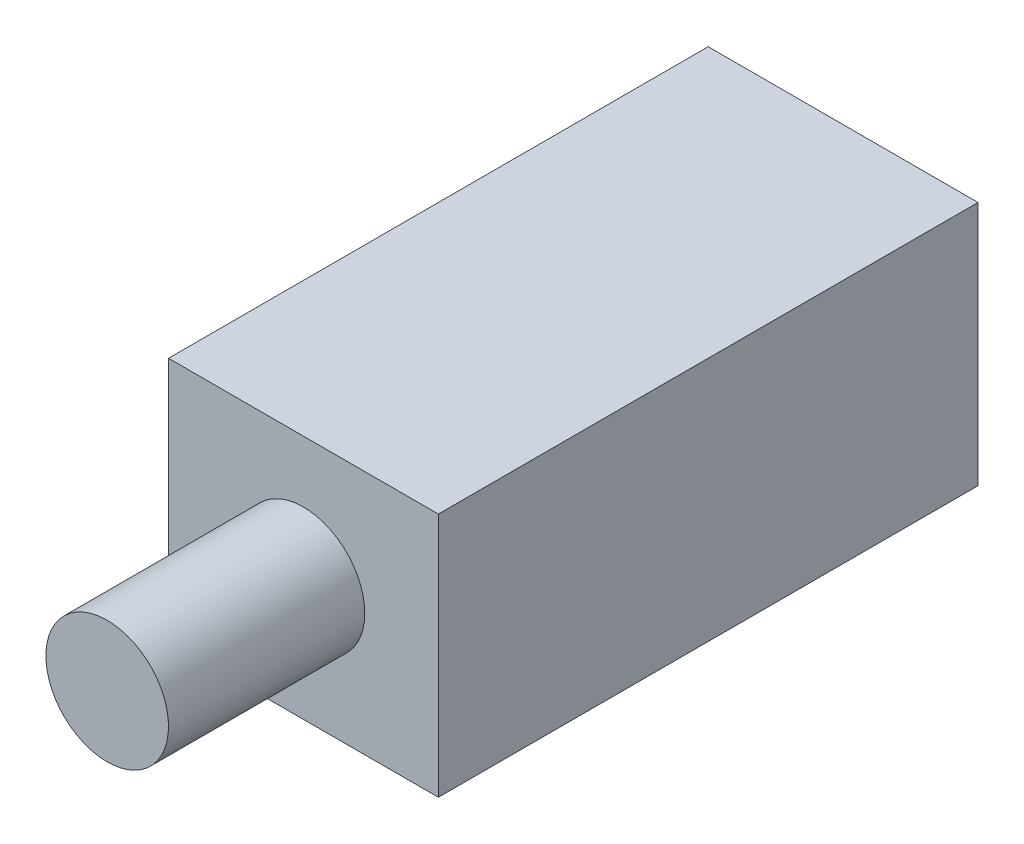
ISO-10303-21;
HEADER;
FILE_DESCRIPTION(('STEP AP214'),'2;1');
FILE_NAME('part.step','',(''),(''),'','','');
FILE_SCHEMA(('AUTOMOTIVE_DESIGN { 1 0 10303 214 1 1 1 1 }'));
ENDSEC;
DATA;
#1=APPLICATION_CONTEXT('core data for automotive mechanical design processes');
#2=APPLICATION_PROTOCOL_DEFINITION('international standard','automotive_design',2000,#1);
#3=PRODUCT_CONTEXT('',#1,'mechanical');
#4=PRODUCT('Part','Part','',(#3));
#5=PRODUCT_RELATED_PRODUCT_CATEGORY('part','',(#4));
#6=PRODUCT_DEFINITION_FORMATION('','',#4);
#7=PRODUCT_DEFINITION_CONTEXT('part definition',#1,'design');
#8=PRODUCT_DEFINITION('design','',#6,#7);
#9=PRODUCT_DEFINITION_SHAPE('','',#8);
#10=(LENGTH_UNIT() NAMED_UNIT(*) SI_UNIT(.MILLI.,.METRE.));
#11=(NAMED_UNIT(*) PLANE_ANGLE_UNIT() SI_UNIT($,.RADIAN.));
#12=(NAMED_UNIT(*) SI_UNIT($,.STERADIAN.) SOLID_ANGLE_UNIT());
#13=UNCERTAINTY_MEASURE_WITH_UNIT(LENGTH_MEASURE(1.E-05),#10,'distance_accuracy_value','');
#14=(GEOMETRIC_REPRESENTATION_CONTEXT(3) GLOBAL_UNCERTAINTY_ASSIGNED_CONTEXT((#13)) GLOBAL_UNIT_ASSIGNED_CONTEXT((#10,
#11,#12)) REPRESENTATION_CONTEXT('',''));
#15=CARTESIAN_POINT('',(0.,0.,0.));
#16=DIRECTION('',(0.,0.,1.));
#17=DIRECTION('',(1.,0.,0.));
#18=AXIS2_PLACEMENT_3D('',#15,#16,#17);
#19=CARTESIAN_POINT('',(-5.5,0.,0.));
#20=DIRECTION('',(0.,0.,1.));
#21=DIRECTION('',(1.,0.,0.));
#22=AXIS2_PLACEMENT_3D('',#19,#20,#21);
#23=PLANE('',#22);
#24=DIRECTION('',(0.,-1.,0.));
#25=VECTOR('',#24,1.);
#26=CARTESIAN_POINT('',(-5.5,10.,0.));
#27=LINE('',#26,#25);
#28=CARTESIAN_POINT('',(-5.5,10.,0.));
#29=VERTEX_POINT('',#28);
#30=CARTESIAN_POINT('',(-5.5,0.,0.));
#31=VERTEX_POINT('',#30);
#32=EDGE_CURVE('E96',#29,#31,#27,.T.);
#33=ORIENTED_EDGE('',*,*,#32,.T.);
#34=DIRECTION('',(1.,0.,0.));
#35=VECTOR('',#34,1.);
#36=CARTESIAN_POINT('',(-5.5,0.,0.));
#37=LINE('',#36,#35);
#38=CARTESIAN_POINT('',(5.5,0.,0.));
#39=VERTEX_POINT('',#38);
#40=EDGE_CURVE('E99',#31,#39,#37,.T.);
#41=ORIENTED_EDGE('',*,*,#40,.T.);
#42=DIRECTION('',(0.,1.,0.));
#43=VECTOR('',#42,1.);
#44=CARTESIAN_POINT('',(5.5,10.,0.));
#45=LINE('',#44,#43);
#46=CARTESIAN_POINT('',(5.5,10.,0.));
#47=VERTEX_POINT('',#46);
#48=EDGE_CURVE('E81',#39,#47,#45,.T.);
#49=ORIENTED_EDGE('',*,*,#48,.T.);
#50=DIRECTION('',(-1.,0.,0.));
#51=VECTOR('',#50,1.);
#52=CARTESIAN_POINT('',(-5.5,10.,0.));
#53=LINE('',#52,#51);
#54=EDGE_CURVE('E91',#47,#29,#53,.T.);
#55=ORIENTED_EDGE('',*,*,#54,.T.);
#56=EDGE_LOOP('',(#33,#41,#49,#55));
#57=FACE_BOUND('',#56,.T.);
#58=CARTESIAN_POINT('',(0.,5.,0.));
#59=DIRECTION('',(0.,0.,1.));
#60=DIRECTION('',(1.,0.,0.));
#61=AXIS2_PLACEMENT_3D('',#58,#59,#60);
#62=CIRCLE('',#61,2.5);
#63=CARTESIAN_POINT('',(2.5,5.,0.));
#64=VERTEX_POINT('',#63);
#65=EDGE_CURVE('E133',#64,#64,#62,.T.);
#66=ORIENTED_EDGE('',*,*,#65,.F.);
#67=EDGE_LOOP('',(#66));
#68=FACE_BOUND('',#67,.T.);
#69=ADVANCED_FACE('F30',(#57,#68),#23,.T.);
#70=CARTESIAN_POINT('',(-5.5,10.,-22.));
#71=DIRECTION('',(-1.,0.,0.));
#72=DIRECTION('',(0.,-1.,0.));
#73=AXIS2_PLACEMENT_3D('',#70,#71,#72);
#74=PLANE('',#73);
#75=ORIENTED_EDGE('',*,*,#32,.F.);
#76=DIRECTION('',(0.,0.,1.));
#77=VECTOR('',#76,1.);
#78=CARTESIAN_POINT('',(-5.5,10.,-22.));
#79=LINE('',#78,#77);
#80=CARTESIAN_POINT('',(-5.5,10.,-22.));
#81=VERTEX_POINT('',#80);
#82=EDGE_CURVE('E11',#81,#29,#79,.T.);
#83=ORIENTED_EDGE('',*,*,#82,.F.);
#84=DIRECTION('',(0.,-1.,0.));
#85=VECTOR('',#84,1.);
#86=CARTESIAN_POINT('',(-5.5,10.,-22.));
#87=LINE('',#86,#85);
#88=CARTESIAN_POINT('',(-5.5,0.,-22.));
#89=VERTEX_POINT('',#88);
#90=EDGE_CURVE('E89',#81,#89,#87,.T.);
#91=ORIENTED_EDGE('',*,*,#90,.T.);
#92=DIRECTION('',(0.,0.,1.));
#93=VECTOR('',#92,1.);
#94=CARTESIAN_POINT('',(-5.5,0.,-22.));
#95=LINE('',#94,#93);
#96=EDGE_CURVE('E34',#89,#31,#95,.T.);
#97=ORIENTED_EDGE('',*,*,#96,.T.);
#98=EDGE_LOOP('',(#75,#83,#91,#97));
#99=FACE_BOUND('',#98,.T.);
#100=ADVANCED_FACE('F32',(#99),#74,.T.);
#101=CARTESIAN_POINT('',(-5.5,10.,-22.));
#102=DIRECTION('',(0.,1.,0.));
#103=DIRECTION('',(0.,0.,1.));
#104=AXIS2_PLACEMENT_3D('',#101,#102,#103);
#105=PLANE('',#104);
#106=ORIENTED_EDGE('',*,*,#54,.F.);
#107=DIRECTION('',(0.,0.,1.));
#108=VECTOR('',#107,1.);
#109=CARTESIAN_POINT('',(5.5,10.,-22.));
#110=LINE('',#109,#108);
#111=CARTESIAN_POINT('',(5.5,10.,-22.));
#112=VERTEX_POINT('',#111);
#113=EDGE_CURVE('E40',#112,#47,#110,.T.);
#114=ORIENTED_EDGE('',*,*,#113,.F.);
#115=DIRECTION('',(-1.,0.,0.));
#116=VECTOR('',#115,1.);
#117=CARTESIAN_POINT('',(-5.5,10.,-22.));
#118=LINE('',#117,#116);
#119=EDGE_CURVE('E86',#112,#81,#118,.T.);
#120=ORIENTED_EDGE('',*,*,#119,.T.);
#121=ORIENTED_EDGE('',*,*,#82,.T.);
#122=EDGE_LOOP('',(#106,#114,#120,#121));
#123=FACE_BOUND('',#122,.T.);
#124=ADVANCED_FACE('F107',(#123),#105,.T.);
#125=CARTESIAN_POINT('',(5.5,10.,-22.));
#126=DIRECTION('',(1.,0.,0.));
#127=DIRECTION('',(0.,1.,0.));
#128=AXIS2_PLACEMENT_3D('',#125,#126,#127);
#129=PLANE('',#128);
#130=ORIENTED_EDGE('',*,*,#48,.F.);
#131=DIRECTION('',(0.,0.,1.));
#132=VECTOR('',#131,1.);
#133=CARTESIAN_POINT('',(5.5,0.,-22.));
#134=LINE('',#133,#132);
#135=CARTESIAN_POINT('',(5.5,0.,-22.));
#136=VERTEX_POINT('',#135);
#137=EDGE_CURVE('E76',#136,#39,#134,.T.);
#138=ORIENTED_EDGE('',*,*,#137,.F.);
#139=DIRECTION('',(0.,1.,0.));
#140=VECTOR('',#139,1.);
#141=CARTESIAN_POINT('',(5.5,10.,-22.));
#142=LINE('',#141,#140);
#143=EDGE_CURVE('E79',#136,#112,#142,.T.);
#144=ORIENTED_EDGE('',*,*,#143,.T.);
#145=ORIENTED_EDGE('',*,*,#113,.T.);
#146=EDGE_LOOP('',(#130,#138,#144,#145));
#147=FACE_BOUND('',#146,.T.);
#148=ADVANCED_FACE('F78',(#147),#129,.T.);
#149=CARTESIAN_POINT('',(-5.5,0.,-22.));
#150=DIRECTION('',(0.,-1.,0.));
#151=DIRECTION('',(0.,0.,-1.));
#152=AXIS2_PLACEMENT_3D('',#149,#150,#151);
#153=PLANE('',#152);
#154=ORIENTED_EDGE('',*,*,#40,.F.);
#155=ORIENTED_EDGE('',*,*,#96,.F.);
#156=DIRECTION('',(1.,0.,0.));
#157=VECTOR('',#156,1.);
#158=CARTESIAN_POINT('',(-5.5,0.,-22.));
#159=LINE('',#158,#157);
#160=EDGE_CURVE('E85',#89,#136,#159,.T.);
#161=ORIENTED_EDGE('',*,*,#160,.T.);
#162=ORIENTED_EDGE('',*,*,#137,.T.);
#163=EDGE_LOOP('',(#154,#155,#161,#162));
#164=FACE_BOUND('',#163,.T.);
#165=ADVANCED_FACE('F88',(#164),#153,.T.);
#166=CARTESIAN_POINT('',(-5.5,0.,-22.));
#167=DIRECTION('',(0.,0.,1.));
#168=DIRECTION('',(1.,0.,0.));
#169=AXIS2_PLACEMENT_3D('',#166,#167,#168);
#170=PLANE('',#169);
#171=ORIENTED_EDGE('',*,*,#90,.F.);
#172=ORIENTED_EDGE('',*,*,#119,.F.);
#173=ORIENTED_EDGE('',*,*,#143,.F.);
#174=ORIENTED_EDGE('',*,*,#160,.F.);
#175=EDGE_LOOP('',(#171,#172,#173,#174));
#176=FACE_BOUND('',#175,.T.);
#177=ADVANCED_FACE('F84',(#176),#170,.F.);
#178=CARTESIAN_POINT('',(0.,5.,8.));
#179=DIRECTION('',(0.,0.,-1.));
#180=DIRECTION('',(-1.,0.,0.));
#181=AXIS2_PLACEMENT_3D('',#178,#179,#180);
#182=CYLINDRICAL_SURFACE('',#181,2.5);
#183=CARTESIAN_POINT('',(0.,5.,8.));
#184=DIRECTION('',(0.,0.,1.));
#185=DIRECTION('',(1.,0.,0.));
#186=AXIS2_PLACEMENT_3D('',#183,#184,#185);
#187=CIRCLE('',#186,2.5);
#188=CARTESIAN_POINT('',(2.5,5.,8.));
#189=VERTEX_POINT('',#188);
#190=EDGE_CURVE('E100',#189,#189,#187,.T.);
#191=ORIENTED_EDGE('',*,*,#190,.F.);
#192=EDGE_LOOP('',(#191));
#193=FACE_BOUND('',#192,.T.);
#194=ORIENTED_EDGE('',*,*,#65,.T.);
#195=EDGE_LOOP('',(#194));
#196=FACE_BOUND('',#195,.T.);
#197=ADVANCED_FACE('F122',(#193,#196),#182,.T.);
#198=CARTESIAN_POINT('',(0.,5.,8.));
#199=DIRECTION('',(0.,0.,1.));
#200=DIRECTION('',(1.,0.,0.));
#201=AXIS2_PLACEMENT_3D('',#198,#199,#200);
#202=PLANE('',#201);
#203=ORIENTED_EDGE('',*,*,#190,.T.);
#204=EDGE_LOOP('',(#203));
#205=FACE_BOUND('',#204,.T.);
#206=ADVANCED_FACE('F125',(#205),#202,.T.);
#207=CLOSED_SHELL('',(#69,#100,#124,#148,#165,#177,#197,#206));
#208=MANIFOLD_SOLID_BREP('B2',#207);
#209=ADVANCED_BREP_SHAPE_REPRESENTATION('',(#18,#208),#14);
#210=SHAPE_DEFINITION_REPRESENTATION(#9,#209);
ENDSEC;
END-ISO-10303-21;
